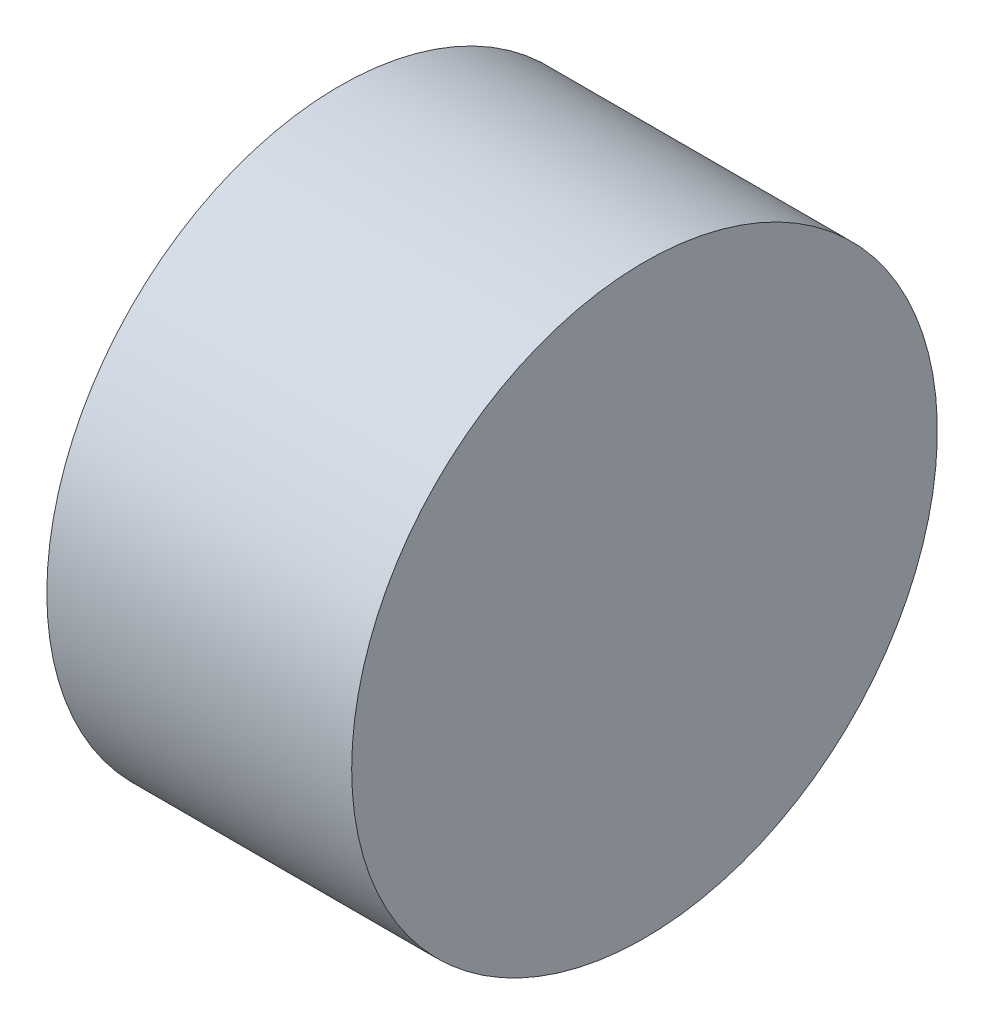
ISO-10303-21;
HEADER;
FILE_DESCRIPTION(('STEP AP214'),'2;1');
FILE_NAME('part.step','',(''),(''),'','','');
FILE_SCHEMA(('AUTOMOTIVE_DESIGN { 1 0 10303 214 1 1 1 1 }'));
ENDSEC;
DATA;
#1=APPLICATION_CONTEXT('core data for automotive mechanical design processes');
#2=APPLICATION_PROTOCOL_DEFINITION('international standard','automotive_design',2000,#1);
#3=PRODUCT_CONTEXT('',#1,'mechanical');
#4=PRODUCT('Part','Part','',(#3));
#5=PRODUCT_RELATED_PRODUCT_CATEGORY('part','',(#4));
#6=PRODUCT_DEFINITION_FORMATION('','',#4);
#7=PRODUCT_DEFINITION_CONTEXT('part definition',#1,'design');
#8=PRODUCT_DEFINITION('design','',#6,#7);
#9=PRODUCT_DEFINITION_SHAPE('','',#8);
#10=(LENGTH_UNIT() NAMED_UNIT(*) SI_UNIT(.MILLI.,.METRE.));
#11=(NAMED_UNIT(*) PLANE_ANGLE_UNIT() SI_UNIT($,.RADIAN.));
#12=(NAMED_UNIT(*) SI_UNIT($,.STERADIAN.) SOLID_ANGLE_UNIT());
#13=UNCERTAINTY_MEASURE_WITH_UNIT(LENGTH_MEASURE(1.E-05),#10,'distance_accuracy_value','');
#14=(GEOMETRIC_REPRESENTATION_CONTEXT(3) GLOBAL_UNCERTAINTY_ASSIGNED_CONTEXT((#13)) GLOBAL_UNIT_ASSIGNED_CONTEXT((#10,
#11,#12)) REPRESENTATION_CONTEXT('',''));
#15=CARTESIAN_POINT('',(0.,0.,0.));
#16=DIRECTION('',(0.,0.,1.));
#17=DIRECTION('',(1.,0.,0.));
#18=AXIS2_PLACEMENT_3D('',#15,#16,#17);
#19=CARTESIAN_POINT('',(0.,0.,-12.2000000000035));
#20=DIRECTION('',(-1.,0.,0.));
#21=DIRECTION('',(0.,0.,1.));
#22=AXIS2_PLACEMENT_3D('',#19,#20,#21);
#23=PLANE('',#22);
#24=CARTESIAN_POINT('',(0.,0.,0.));
#25=DIRECTION('',(-1.,0.,0.));
#26=DIRECTION('',(0.,0.,1.));
#27=AXIS2_PLACEMENT_3D('',#24,#25,#26);
#28=CIRCLE('',#27,12.2000000000035);
#29=CARTESIAN_POINT('',(0.,0.,12.2000000000035));
#30=VERTEX_POINT('',#29);
#31=EDGE_CURVE('E222',#30,#30,#28,.T.);
#32=ORIENTED_EDGE('',*,*,#31,.F.);
#33=EDGE_LOOP('',(#32));
#34=FACE_BOUND('',#33,.T.);
#35=ADVANCED_FACE('F36',(#34),#23,.F.);
#36=CARTESIAN_POINT('',(-16.7,0.,0.));
#37=DIRECTION('',(1.,0.,0.));
#38=DIRECTION('',(0.,0.,-1.));
#39=AXIS2_PLACEMENT_3D('',#36,#37,#38);
#40=PLANE('',#39);
#41=CARTESIAN_POINT('',(-16.7,0.,0.));
#42=DIRECTION('',(-1.,0.,0.));
#43=DIRECTION('',(0.,0.,1.));
#44=AXIS2_PLACEMENT_3D('',#41,#42,#43);
#45=CIRCLE('',#44,3.);
#46=CARTESIAN_POINT('',(-16.7,0.,3.));
#47=VERTEX_POINT('',#46);
#48=EDGE_CURVE('E11',#47,#47,#45,.T.);
#49=ORIENTED_EDGE('',*,*,#48,.T.);
#50=EDGE_LOOP('',(#49));
#51=FACE_BOUND('',#50,.T.);
#52=ADVANCED_FACE('F253',(#51),#40,.F.);
#53=CARTESIAN_POINT('',(-159.613189405079,0.,0.));
#54=DIRECTION('',(-1.,0.,0.));
#55=DIRECTION('',(0.,0.,1.));
#56=AXIS2_PLACEMENT_3D('',#53,#54,#55);
#57=CYLINDRICAL_SURFACE('',#56,3.);
#58=ORIENTED_EDGE('',*,*,#48,.F.);
#59=EDGE_LOOP('',(#58));
#60=FACE_BOUND('',#59,.T.);
#61=CARTESIAN_POINT('',(-12.7,0.,0.));
#62=DIRECTION('',(-1.,0.,0.));
#63=DIRECTION('',(0.,0.,1.));
#64=AXIS2_PLACEMENT_3D('',#61,#62,#63);
#65=CIRCLE('',#64,3.);
#66=CARTESIAN_POINT('',(-12.7,0.,3.));
#67=VERTEX_POINT('',#66);
#68=EDGE_CURVE('E43',#67,#67,#65,.T.);
#69=ORIENTED_EDGE('',*,*,#68,.T.);
#70=EDGE_LOOP('',(#69));
#71=FACE_BOUND('',#70,.T.);
#72=ADVANCED_FACE('F236',(#60,#71),#57,.T.);
#73=CARTESIAN_POINT('',(-12.7,0.,-3.));
#74=DIRECTION('',(1.,0.,0.));
#75=DIRECTION('',(0.,0.,-1.));
#76=AXIS2_PLACEMENT_3D('',#73,#74,#75);
#77=PLANE('',#76);
#78=CARTESIAN_POINT('',(-12.7,-5.0835038482262,0.));
#79=DIRECTION('',(-1.,0.,0.));
#80=DIRECTION('',(0.,0.,1.));
#81=AXIS2_PLACEMENT_3D('',#78,#79,#80);
#82=CIRCLE('',#81,0.65);
#83=CARTESIAN_POINT('',(-12.7,-5.0835038482262,0.649999999999983));
#84=VERTEX_POINT('',#83);
#85=EDGE_CURVE('E385',#84,#84,#82,.T.);
#86=ORIENTED_EDGE('',*,*,#85,.F.);
#87=EDGE_LOOP('',(#86));
#88=FACE_BOUND('',#87,.T.);
#89=CARTESIAN_POINT('',(-12.7,5.0835038482262,0.));
#90=DIRECTION('',(-1.,0.,0.));
#91=DIRECTION('',(0.,0.,1.));
#92=AXIS2_PLACEMENT_3D('',#89,#90,#91);
#93=CIRCLE('',#92,0.65);
#94=CARTESIAN_POINT('',(-12.7,5.0835038482262,0.649999999999982));
#95=VERTEX_POINT('',#94);
#96=EDGE_CURVE('E384',#95,#95,#93,.T.);
#97=ORIENTED_EDGE('',*,*,#96,.F.);
#98=EDGE_LOOP('',(#97));
#99=FACE_BOUND('',#98,.T.);
#100=CARTESIAN_POINT('',(-12.7,-7.57819435487428,-4.85499436866322));
#101=DIRECTION('',(-1.,0.,0.));
#102=DIRECTION('',(0.,0.,1.));
#103=AXIS2_PLACEMENT_3D('',#100,#101,#102);
#104=CIRCLE('',#103,0.749999999999999);
#105=CARTESIAN_POINT('',(-12.7,-7.57819435487428,-4.10499436866322));
#106=VERTEX_POINT('',#105);
#107=EDGE_CURVE('E394',#106,#106,#104,.T.);
#108=ORIENTED_EDGE('',*,*,#107,.F.);
#109=EDGE_LOOP('',(#108));
#110=FACE_BOUND('',#109,.T.);
#111=CARTESIAN_POINT('',(-12.7,-5.16494921498341,-3.3089411776744));
#112=DIRECTION('',(-1.,0.,0.));
#113=DIRECTION('',(0.,0.,1.));
#114=AXIS2_PLACEMENT_3D('',#111,#112,#113);
#115=CIRCLE('',#114,0.749999999999997);
#116=CARTESIAN_POINT('',(-12.7,-5.16494921498341,-2.5589411776744));
#117=VERTEX_POINT('',#116);
#118=EDGE_CURVE('E406',#117,#117,#115,.T.);
#119=ORIENTED_EDGE('',*,*,#118,.F.);
#120=EDGE_LOOP('',(#119));
#121=FACE_BOUND('',#120,.T.);
#122=CARTESIAN_POINT('',(-12.7,-0.415451281055558,8.99040601046857));
#123=DIRECTION('',(-1.,0.,0.));
#124=DIRECTION('',(0.,0.,1.));
#125=AXIS2_PLACEMENT_3D('',#122,#123,#124);
#126=CIRCLE('',#125,0.75);
#127=CARTESIAN_POINT('',(-12.7,-0.415451281055558,9.74040601046857));
#128=VERTEX_POINT('',#127);
#129=EDGE_CURVE('E400',#128,#128,#126,.T.);
#130=ORIENTED_EDGE('',*,*,#129,.F.);
#131=EDGE_LOOP('',(#130));
#132=FACE_BOUND('',#131,.T.);
#133=CARTESIAN_POINT('',(-12.7,-0.283152512002689,6.12744781826933));
#134=DIRECTION('',(-1.,0.,0.));
#135=DIRECTION('',(0.,0.,1.));
#136=AXIS2_PLACEMENT_3D('',#133,#134,#135);
#137=CIRCLE('',#136,0.75);
#138=CARTESIAN_POINT('',(-12.7,-0.283152512002689,6.87744781826933));
#139=VERTEX_POINT('',#138);
#140=EDGE_CURVE('E399',#139,#139,#137,.T.);
#141=ORIENTED_EDGE('',*,*,#140,.F.);
#142=EDGE_LOOP('',(#141));
#143=FACE_BOUND('',#142,.T.);
#144=CARTESIAN_POINT('',(-12.7,7.99364563592984,-4.13541164180542));
#145=DIRECTION('',(-1.,0.,0.));
#146=DIRECTION('',(0.,0.,1.));
#147=AXIS2_PLACEMENT_3D('',#144,#145,#146);
#148=CIRCLE('',#147,0.749999999999999);
#149=CARTESIAN_POINT('',(-12.7,7.99364563592984,-3.38541164180542));
#150=VERTEX_POINT('',#149);
#151=EDGE_CURVE('E417',#150,#150,#148,.T.);
#152=ORIENTED_EDGE('',*,*,#151,.F.);
#153=EDGE_LOOP('',(#152));
#154=FACE_BOUND('',#153,.T.);
#155=CARTESIAN_POINT('',(-12.7,5.44810172698611,-2.81850664059499));
#156=DIRECTION('',(-1.,0.,0.));
#157=DIRECTION('',(0.,0.,1.));
#158=AXIS2_PLACEMENT_3D('',#155,#156,#157);
#159=CIRCLE('',#158,0.749999999999998);
#160=CARTESIAN_POINT('',(-12.7,5.44810172698611,-2.06850664059499));
#161=VERTEX_POINT('',#160);
#162=EDGE_CURVE('E150',#161,#161,#159,.T.);
#163=ORIENTED_EDGE('',*,*,#162,.F.);
#164=EDGE_LOOP('',(#163));
#165=FACE_BOUND('',#164,.T.);
#166=CARTESIAN_POINT('',(-12.7,0.,0.));
#167=DIRECTION('',(-1.,0.,0.));
#168=DIRECTION('',(0.,0.,1.));
#169=AXIS2_PLACEMENT_3D('',#166,#167,#168);
#170=CIRCLE('',#169,11.);
#171=CARTESIAN_POINT('',(-12.7,7.69478931895491,7.86067537409461));
#172=VERTEX_POINT('',#171);
#173=CARTESIAN_POINT('',(-12.7,10.357432093874,3.70453781473321));
#174=VERTEX_POINT('',#173);
#175=EDGE_CURVE('E156',#172,#174,#170,.T.);
#176=ORIENTED_EDGE('',*,*,#175,.F.);
#177=CARTESIAN_POINT('',(-12.7,7.70986986942216,6.44654222018102));
#178=DIRECTION('',(-1.,0.,0.));
#179=DIRECTION('',(0.,0.,1.));
#180=AXIS2_PLACEMENT_3D('',#177,#178,#179);
#181=CIRCLE('',#180,1.41421356237309);
#182=CARTESIAN_POINT('',(-12.7,6.29573671550856,6.43146166971377));
#183=VERTEX_POINT('',#182);
#184=EDGE_CURVE('E50',#183,#172,#181,.T.);
#185=ORIENTED_EDGE('',*,*,#184,.F.);
#186=CARTESIAN_POINT('',(-12.7,0.,0.));
#187=DIRECTION('',(1.,0.,0.));
#188=DIRECTION('',(0.,0.,1.));
#189=AXIS2_PLACEMENT_3D('',#186,#187,#188);
#190=CIRCLE('',#189,9.);
#191=CARTESIAN_POINT('',(-12.7,8.47426262226057,3.03098548478172));
#192=VERTEX_POINT('',#191);
#193=EDGE_CURVE('E144',#192,#183,#190,.T.);
#194=ORIENTED_EDGE('',*,*,#193,.F.);
#195=CARTESIAN_POINT('',(-12.7,9.07907119309155,4.3093463855642));
#196=DIRECTION('',(-1.,0.,0.));
#197=DIRECTION('',(0.,0.,-1.));
#198=AXIS2_PLACEMENT_3D('',#195,#196,#197);
#199=CIRCLE('',#198,1.4142135623731);
#200=EDGE_CURVE('E147',#174,#192,#199,.T.);
#201=ORIENTED_EDGE('',*,*,#200,.F.);
#202=EDGE_LOOP('',(#176,#185,#194,#201));
#203=FACE_BOUND('',#202,.T.);
#204=CARTESIAN_POINT('',(-12.7,0.,0.));
#205=DIRECTION('',(-1.,0.,0.));
#206=DIRECTION('',(0.,0.,1.));
#207=AXIS2_PLACEMENT_3D('',#204,#205,#206);
#208=CIRCLE('',#207,11.);
#209=CARTESIAN_POINT('',(-12.7,-10.6549392243461,2.73354533993676));
#210=VERTEX_POINT('',#209);
#211=CARTESIAN_POINT('',(-12.7,-8.3869399037761,7.11753040390052));
#212=VERTEX_POINT('',#211);
#213=EDGE_CURVE('E182',#210,#212,#208,.T.);
#214=ORIENTED_EDGE('',*,*,#213,.F.);
#215=CARTESIAN_POINT('',(-12.7,-9.43780426395679,3.45367205670125));
#216=DIRECTION('',(-1.,0.,0.));
#217=DIRECTION('',(0.,0.,1.));
#218=AXIS2_PLACEMENT_3D('',#215,#216,#217);
#219=CIRCLE('',#218,1.4142135623731);
#220=CARTESIAN_POINT('',(-12.7,-8.7176775471923,2.2365370963119));
#221=VERTEX_POINT('',#220);
#222=EDGE_CURVE('E58',#221,#210,#219,.T.);
#223=ORIENTED_EDGE('',*,*,#222,.F.);
#224=CARTESIAN_POINT('',(-12.7,0.,0.));
#225=DIRECTION('',(1.,0.,0.));
#226=DIRECTION('',(0.,0.,1.));
#227=AXIS2_PLACEMENT_3D('',#224,#225,#226);
#228=CIRCLE('',#227,9.);
#229=CARTESIAN_POINT('',(-12.7,-6.86204173945317,5.82343396682769));
#230=VERTEX_POINT('',#229);
#231=EDGE_CURVE('E171',#230,#221,#228,.T.);
#232=ORIENTED_EDGE('',*,*,#231,.F.);
#233=CARTESIAN_POINT('',(-12.7,-8.27153904015104,5.70803310320264));
#234=DIRECTION('',(-1.,0.,0.));
#235=DIRECTION('',(0.,0.,-1.));
#236=AXIS2_PLACEMENT_3D('',#233,#234,#235);
#237=CIRCLE('',#236,1.4142135623731);
#238=EDGE_CURVE('E186',#212,#230,#237,.T.);
#239=ORIENTED_EDGE('',*,*,#238,.F.);
#240=EDGE_LOOP('',(#214,#223,#232,#239));
#241=FACE_BOUND('',#240,.T.);
#242=CARTESIAN_POINT('',(-12.7,0.,0.));
#243=DIRECTION('',(-1.,0.,0.));
#244=DIRECTION('',(0.,0.,1.));
#245=AXIS2_PLACEMENT_3D('',#242,#243,#244);
#246=CIRCLE('',#245,11.);
#247=CARTESIAN_POINT('',(-12.7,2.96014990539117,-10.5942207140314));
#248=VERTEX_POINT('',#247);
#249=CARTESIAN_POINT('',(-12.7,-1.97049219009802,-10.8220682186338));
#250=VERTEX_POINT('',#249);
#251=EDGE_CURVE('E212',#248,#250,#246,.T.);
#252=ORIENTED_EDGE('',*,*,#251,.F.);
#253=CARTESIAN_POINT('',(-12.7,1.72793439453457,-9.90021427688231));
#254=DIRECTION('',(-1.,0.,0.));
#255=DIRECTION('',(0.,0.,1.));
#256=AXIS2_PLACEMENT_3D('',#253,#254,#255);
#257=CIRCLE('',#256,1.41421356237309);
#258=CARTESIAN_POINT('',(-12.7,2.42194083168369,-8.66799876602571));
#259=VERTEX_POINT('',#258);
#260=EDGE_CURVE('E163',#259,#248,#257,.T.);
#261=ORIENTED_EDGE('',*,*,#260,.F.);
#262=CARTESIAN_POINT('',(-12.7,0.,0.));
#263=DIRECTION('',(1.,0.,0.));
#264=DIRECTION('',(0.,0.,1.));
#265=AXIS2_PLACEMENT_3D('',#262,#263,#264);
#266=CIRCLE('',#265,9.);
#267=CARTESIAN_POINT('',(-12.7,-1.61222088280747,-8.85441945160943));
#268=VERTEX_POINT('',#267);
#269=EDGE_CURVE('E201',#268,#259,#266,.T.);
#270=ORIENTED_EDGE('',*,*,#269,.F.);
#271=CARTESIAN_POINT('',(-12.7,-0.807532152940578,-10.0173794887669));
#272=DIRECTION('',(-1.,0.,0.));
#273=DIRECTION('',(0.,0.,-1.));
#274=AXIS2_PLACEMENT_3D('',#271,#272,#273);
#275=CIRCLE('',#274,1.4142135623731);
#276=EDGE_CURVE('E215',#250,#268,#275,.T.);
#277=ORIENTED_EDGE('',*,*,#276,.F.);
#278=EDGE_LOOP('',(#252,#261,#270,#277));
#279=FACE_BOUND('',#278,.T.);
#280=ORIENTED_EDGE('',*,*,#68,.F.);
#281=EDGE_LOOP('',(#280));
#282=FACE_BOUND('',#281,.T.);
#283=CARTESIAN_POINT('',(-12.7,0.,0.));
#284=DIRECTION('',(-1.,0.,0.));
#285=DIRECTION('',(0.,0.,1.));
#286=AXIS2_PLACEMENT_3D('',#283,#284,#285);
#287=CIRCLE('',#286,12.2);
#288=CARTESIAN_POINT('',(-12.7,0.,12.2));
#289=VERTEX_POINT('',#288);
#290=EDGE_CURVE('E231',#289,#289,#287,.T.);
#291=ORIENTED_EDGE('',*,*,#290,.T.);
#292=EDGE_LOOP('',(#291));
#293=FACE_BOUND('',#292,.T.);
#294=ADVANCED_FACE('F238',(#88,#99,#110,#121,#132,#143,#154,#165,#203,#241,#279,#282,#293),#77,.F.);
#295=CARTESIAN_POINT('',(-159.613189405079,0.,0.));
#296=DIRECTION('',(-1.,0.,0.));
#297=DIRECTION('',(0.,0.,1.));
#298=AXIS2_PLACEMENT_3D('',#295,#296,#297);
#299=CYLINDRICAL_SURFACE('',#298,12.2000000000018);
#300=ORIENTED_EDGE('',*,*,#290,.F.);
#301=EDGE_LOOP('',(#300));
#302=FACE_BOUND('',#301,.T.);
#303=ORIENTED_EDGE('',*,*,#31,.T.);
#304=EDGE_LOOP('',(#303));
#305=FACE_BOUND('',#304,.T.);
#306=ADVANCED_FACE('F241',(#302,#305),#299,.T.);
#307=CARTESIAN_POINT('',(-9.7,1.72793439453457,-9.90021427688231));
#308=DIRECTION('',(-1.,0.,0.));
#309=DIRECTION('',(0.,0.,1.));
#310=AXIS2_PLACEMENT_3D('',#307,#308,#309);
#311=CYLINDRICAL_SURFACE('',#310,1.41421356237309);
#312=ORIENTED_EDGE('',*,*,#260,.T.);
#313=DIRECTION('',(-1.,0.,0.));
#314=VECTOR('',#313,1.);
#315=CARTESIAN_POINT('',(-9.7,2.96014990539117,-10.5942207140314));
#316=LINE('',#315,#314);
#317=CARTESIAN_POINT('',(-9.7,2.96014990539117,-10.5942207140314));
#318=VERTEX_POINT('',#317);
#319=EDGE_CURVE('E210',#318,#248,#316,.T.);
#320=ORIENTED_EDGE('',*,*,#319,.F.);
#321=CARTESIAN_POINT('',(-9.7,1.72793439453457,-9.90021427688231));
#322=DIRECTION('',(-1.,0.,0.));
#323=DIRECTION('',(0.,0.,1.));
#324=AXIS2_PLACEMENT_3D('',#321,#322,#323);
#325=CIRCLE('',#324,1.41421356237309);
#326=CARTESIAN_POINT('',(-9.7,2.42194083168369,-8.66799876602571));
#327=VERTEX_POINT('',#326);
#328=EDGE_CURVE('E197',#327,#318,#325,.T.);
#329=ORIENTED_EDGE('',*,*,#328,.F.);
#330=DIRECTION('',(-1.,0.,0.));
#331=VECTOR('',#330,1.);
#332=CARTESIAN_POINT('',(-9.7,2.42194083168369,-8.66799876602571));
#333=LINE('',#332,#331);
#334=EDGE_CURVE('E220',#327,#259,#333,.T.);
#335=ORIENTED_EDGE('',*,*,#334,.T.);
#336=EDGE_LOOP('',(#312,#320,#329,#335));
#337=FACE_BOUND('',#336,.T.);
#338=ADVANCED_FACE('F248',(#337),#311,.F.);
#339=CARTESIAN_POINT('',(-9.7,0.,0.));
#340=DIRECTION('',(-1.,0.,0.));
#341=DIRECTION('',(0.,0.,1.));
#342=AXIS2_PLACEMENT_3D('',#339,#340,#341);
#343=CYLINDRICAL_SURFACE('',#342,9.);
#344=ORIENTED_EDGE('',*,*,#269,.T.);
#345=ORIENTED_EDGE('',*,*,#334,.F.);
#346=CARTESIAN_POINT('',(-9.7,0.,0.));
#347=DIRECTION('',(1.,0.,0.));
#348=DIRECTION('',(0.,0.,1.));
#349=AXIS2_PLACEMENT_3D('',#346,#347,#348);
#350=CIRCLE('',#349,9.);
#351=CARTESIAN_POINT('',(-9.7,-1.61222088280747,-8.85441945160943));
#352=VERTEX_POINT('',#351);
#353=EDGE_CURVE('E207',#352,#327,#350,.T.);
#354=ORIENTED_EDGE('',*,*,#353,.F.);
#355=DIRECTION('',(-1.,0.,0.));
#356=VECTOR('',#355,1.);
#357=CARTESIAN_POINT('',(-9.7,-1.61222088280747,-8.85441945160943));
#358=LINE('',#357,#356);
#359=EDGE_CURVE('E223',#352,#268,#358,.T.);
#360=ORIENTED_EDGE('',*,*,#359,.T.);
#361=EDGE_LOOP('',(#344,#345,#354,#360));
#362=FACE_BOUND('',#361,.T.);
#363=ADVANCED_FACE('F266',(#362),#343,.T.);
#364=CARTESIAN_POINT('',(-9.7,-0.807532152940578,-10.0173794887669));
#365=DIRECTION('',(-1.,0.,0.));
#366=DIRECTION('',(0.,0.,1.));
#367=AXIS2_PLACEMENT_3D('',#364,#365,#366);
#368=CYLINDRICAL_SURFACE('',#367,1.4142135623731);
#369=ORIENTED_EDGE('',*,*,#276,.T.);
#370=ORIENTED_EDGE('',*,*,#359,.F.);
#371=CARTESIAN_POINT('',(-9.7,-0.807532152940578,-10.0173794887669));
#372=DIRECTION('',(-1.,0.,0.));
#373=DIRECTION('',(0.,0.,-1.));
#374=AXIS2_PLACEMENT_3D('',#371,#372,#373);
#375=CIRCLE('',#374,1.4142135623731);
#376=CARTESIAN_POINT('',(-9.7,-1.97049219009802,-10.8220682186338));
#377=VERTEX_POINT('',#376);
#378=EDGE_CURVE('E204',#377,#352,#375,.T.);
#379=ORIENTED_EDGE('',*,*,#378,.F.);
#380=DIRECTION('',(-1.,0.,0.));
#381=VECTOR('',#380,1.);
#382=CARTESIAN_POINT('',(-9.7,-1.97049219009802,-10.8220682186338));
#383=LINE('',#382,#381);
#384=EDGE_CURVE('E225',#377,#250,#383,.T.);
#385=ORIENTED_EDGE('',*,*,#384,.T.);
#386=EDGE_LOOP('',(#369,#370,#379,#385));
#387=FACE_BOUND('',#386,.T.);
#388=ADVANCED_FACE('F272',(#387),#368,.F.);
#389=CARTESIAN_POINT('',(-9.7,0.,0.));
#390=DIRECTION('',(-1.,0.,0.));
#391=DIRECTION('',(0.,0.,1.));
#392=AXIS2_PLACEMENT_3D('',#389,#390,#391);
#393=CYLINDRICAL_SURFACE('',#392,11.);
#394=ORIENTED_EDGE('',*,*,#251,.T.);
#395=ORIENTED_EDGE('',*,*,#384,.F.);
#396=CARTESIAN_POINT('',(-9.7,0.,0.));
#397=DIRECTION('',(-1.,0.,0.));
#398=DIRECTION('',(0.,0.,1.));
#399=AXIS2_PLACEMENT_3D('',#396,#397,#398);
#400=CIRCLE('',#399,11.);
#401=EDGE_CURVE('E200',#318,#377,#400,.T.);
#402=ORIENTED_EDGE('',*,*,#401,.F.);
#403=ORIENTED_EDGE('',*,*,#319,.T.);
#404=EDGE_LOOP('',(#394,#395,#402,#403));
#405=FACE_BOUND('',#404,.T.);
#406=ADVANCED_FACE('F268',(#405),#393,.F.);
#407=CARTESIAN_POINT('',(-9.7,0.863967197267286,-4.95010713844116));
#408=DIRECTION('',(-1.,0.,0.));
#409=DIRECTION('',(0.,0.,1.));
#410=AXIS2_PLACEMENT_3D('',#407,#408,#409);
#411=PLANE('',#410);
#412=ORIENTED_EDGE('',*,*,#328,.T.);
#413=ORIENTED_EDGE('',*,*,#401,.T.);
#414=ORIENTED_EDGE('',*,*,#378,.T.);
#415=ORIENTED_EDGE('',*,*,#353,.T.);
#416=EDGE_LOOP('',(#412,#413,#414,#415));
#417=FACE_BOUND('',#416,.T.);
#418=ADVANCED_FACE('F271',(#417),#411,.T.);
#419=CARTESIAN_POINT('',(-9.7,-9.43780426395679,3.45367205670125));
#420=DIRECTION('',(-1.,0.,0.));
#421=DIRECTION('',(0.,0.,1.));
#422=AXIS2_PLACEMENT_3D('',#419,#420,#421);
#423=CYLINDRICAL_SURFACE('',#422,1.4142135623731);
#424=ORIENTED_EDGE('',*,*,#222,.T.);
#425=DIRECTION('',(-1.,0.,0.));
#426=VECTOR('',#425,1.);
#427=CARTESIAN_POINT('',(-9.7,-10.6549392243461,2.73354533993676));
#428=LINE('',#427,#426);
#429=CARTESIAN_POINT('',(-9.7,-10.6549392243461,2.73354533993676));
#430=VERTEX_POINT('',#429);
#431=EDGE_CURVE('E180',#430,#210,#428,.T.);
#432=ORIENTED_EDGE('',*,*,#431,.F.);
#433=CARTESIAN_POINT('',(-9.7,-9.43780426395679,3.45367205670125));
#434=DIRECTION('',(-1.,0.,0.));
#435=DIRECTION('',(0.,0.,1.));
#436=AXIS2_PLACEMENT_3D('',#433,#434,#435);
#437=CIRCLE('',#436,1.4142135623731);
#438=CARTESIAN_POINT('',(-9.7,-8.7176775471923,2.2365370963119));
#439=VERTEX_POINT('',#438);
#440=EDGE_CURVE('E167',#439,#430,#437,.T.);
#441=ORIENTED_EDGE('',*,*,#440,.F.);
#442=DIRECTION('',(-1.,0.,0.));
#443=VECTOR('',#442,1.);
#444=CARTESIAN_POINT('',(-9.7,-8.7176775471923,2.2365370963119));
#445=LINE('',#444,#443);
#446=EDGE_CURVE('E157',#439,#221,#445,.T.);
#447=ORIENTED_EDGE('',*,*,#446,.T.);
#448=EDGE_LOOP('',(#424,#432,#441,#447));
#449=FACE_BOUND('',#448,.T.);
#450=ADVANCED_FACE('F282',(#449),#423,.F.);
#451=CARTESIAN_POINT('',(-9.7,0.,0.));
#452=DIRECTION('',(-1.,0.,0.));
#453=DIRECTION('',(0.,0.,1.));
#454=AXIS2_PLACEMENT_3D('',#451,#452,#453);
#455=CYLINDRICAL_SURFACE('',#454,9.);
#456=ORIENTED_EDGE('',*,*,#231,.T.);
#457=ORIENTED_EDGE('',*,*,#446,.F.);
#458=CARTESIAN_POINT('',(-9.7,0.,0.));
#459=DIRECTION('',(1.,0.,0.));
#460=DIRECTION('',(0.,0.,1.));
#461=AXIS2_PLACEMENT_3D('',#458,#459,#460);
#462=CIRCLE('',#461,9.);
#463=CARTESIAN_POINT('',(-9.7,-6.86204173945317,5.82343396682769));
#464=VERTEX_POINT('',#463);
#465=EDGE_CURVE('E177',#464,#439,#462,.T.);
#466=ORIENTED_EDGE('',*,*,#465,.F.);
#467=DIRECTION('',(-1.,0.,0.));
#468=VECTOR('',#467,1.);
#469=CARTESIAN_POINT('',(-9.7,-6.86204173945317,5.82343396682769));
#470=LINE('',#469,#468);
#471=EDGE_CURVE('E192',#464,#230,#470,.T.);
#472=ORIENTED_EDGE('',*,*,#471,.T.);
#473=EDGE_LOOP('',(#456,#457,#466,#472));
#474=FACE_BOUND('',#473,.T.);
#475=ADVANCED_FACE('F286',(#474),#455,.T.);
#476=CARTESIAN_POINT('',(-9.7,-8.27153904015104,5.70803310320264));
#477=DIRECTION('',(-1.,0.,0.));
#478=DIRECTION('',(0.,0.,1.));
#479=AXIS2_PLACEMENT_3D('',#476,#477,#478);
#480=CYLINDRICAL_SURFACE('',#479,1.4142135623731);
#481=ORIENTED_EDGE('',*,*,#238,.T.);
#482=ORIENTED_EDGE('',*,*,#471,.F.);
#483=CARTESIAN_POINT('',(-9.7,-8.27153904015104,5.70803310320264));
#484=DIRECTION('',(-1.,0.,0.));
#485=DIRECTION('',(0.,0.,-1.));
#486=AXIS2_PLACEMENT_3D('',#483,#484,#485);
#487=CIRCLE('',#486,1.4142135623731);
#488=CARTESIAN_POINT('',(-9.7,-8.3869399037761,7.11753040390052));
#489=VERTEX_POINT('',#488);
#490=EDGE_CURVE('E174',#489,#464,#487,.T.);
#491=ORIENTED_EDGE('',*,*,#490,.F.);
#492=DIRECTION('',(-1.,0.,0.));
#493=VECTOR('',#492,1.);
#494=CARTESIAN_POINT('',(-9.7,-8.3869399037761,7.11753040390052));
#495=LINE('',#494,#493);
#496=EDGE_CURVE('E194',#489,#212,#495,.T.);
#497=ORIENTED_EDGE('',*,*,#496,.T.);
#498=EDGE_LOOP('',(#481,#482,#491,#497));
#499=FACE_BOUND('',#498,.T.);
#500=ADVANCED_FACE('F291',(#499),#480,.F.);
#501=CARTESIAN_POINT('',(-9.7,0.,0.));
#502=DIRECTION('',(-1.,0.,0.));
#503=DIRECTION('',(0.,0.,1.));
#504=AXIS2_PLACEMENT_3D('',#501,#502,#503);
#505=CYLINDRICAL_SURFACE('',#504,11.);
#506=ORIENTED_EDGE('',*,*,#213,.T.);
#507=ORIENTED_EDGE('',*,*,#496,.F.);
#508=CARTESIAN_POINT('',(-9.7,0.,0.));
#509=DIRECTION('',(-1.,0.,0.));
#510=DIRECTION('',(0.,0.,1.));
#511=AXIS2_PLACEMENT_3D('',#508,#509,#510);
#512=CIRCLE('',#511,11.);
#513=EDGE_CURVE('E170',#430,#489,#512,.T.);
#514=ORIENTED_EDGE('',*,*,#513,.F.);
#515=ORIENTED_EDGE('',*,*,#431,.T.);
#516=EDGE_LOOP('',(#506,#507,#514,#515));
#517=FACE_BOUND('',#516,.T.);
#518=ADVANCED_FACE('F287',(#517),#505,.F.);
#519=CARTESIAN_POINT('',(-9.7,-4.71890213197839,1.72683602835062));
#520=DIRECTION('',(-1.,0.,0.));
#521=DIRECTION('',(0.,0.,1.));
#522=AXIS2_PLACEMENT_3D('',#519,#520,#521);
#523=PLANE('',#522);
#524=ORIENTED_EDGE('',*,*,#440,.T.);
#525=ORIENTED_EDGE('',*,*,#513,.T.);
#526=ORIENTED_EDGE('',*,*,#490,.T.);
#527=ORIENTED_EDGE('',*,*,#465,.T.);
#528=EDGE_LOOP('',(#524,#525,#526,#527));
#529=FACE_BOUND('',#528,.T.);
#530=ADVANCED_FACE('F290',(#529),#523,.T.);
#531=CARTESIAN_POINT('',(-9.7,7.70986986942216,6.44654222018102));
#532=DIRECTION('',(-1.,0.,0.));
#533=DIRECTION('',(0.,0.,1.));
#534=AXIS2_PLACEMENT_3D('',#531,#532,#533);
#535=CYLINDRICAL_SURFACE('',#534,1.41421356237309);
#536=ORIENTED_EDGE('',*,*,#184,.T.);
#537=DIRECTION('',(-1.,0.,0.));
#538=VECTOR('',#537,1.);
#539=CARTESIAN_POINT('',(-9.7,7.69478931895491,7.86067537409461));
#540=LINE('',#539,#538);
#541=CARTESIAN_POINT('',(-9.7,7.69478931895491,7.86067537409461));
#542=VERTEX_POINT('',#541);
#543=EDGE_CURVE('E122',#542,#172,#540,.T.);
#544=ORIENTED_EDGE('',*,*,#543,.F.);
#545=CARTESIAN_POINT('',(-9.7,7.70986986942216,6.44654222018102));
#546=DIRECTION('',(-1.,0.,0.));
#547=DIRECTION('',(0.,0.,1.));
#548=AXIS2_PLACEMENT_3D('',#545,#546,#547);
#549=CIRCLE('',#548,1.41421356237309);
#550=CARTESIAN_POINT('',(-9.7,6.29573671550856,6.43146166971377));
#551=VERTEX_POINT('',#550);
#552=EDGE_CURVE('E126',#551,#542,#549,.T.);
#553=ORIENTED_EDGE('',*,*,#552,.F.);
#554=DIRECTION('',(-1.,0.,0.));
#555=VECTOR('',#554,1.);
#556=CARTESIAN_POINT('',(-9.7,6.29573671550856,6.43146166971377));
#557=LINE('',#556,#555);
#558=EDGE_CURVE('E161',#551,#183,#557,.T.);
#559=ORIENTED_EDGE('',*,*,#558,.T.);
#560=EDGE_LOOP('',(#536,#544,#553,#559));
#561=FACE_BOUND('',#560,.T.);
#562=ADVANCED_FACE('F124',(#561),#535,.F.);
#563=CARTESIAN_POINT('',(-9.7,0.,0.));
#564=DIRECTION('',(-1.,0.,0.));
#565=DIRECTION('',(0.,0.,1.));
#566=AXIS2_PLACEMENT_3D('',#563,#564,#565);
#567=CYLINDRICAL_SURFACE('',#566,9.);
#568=ORIENTED_EDGE('',*,*,#193,.T.);
#569=ORIENTED_EDGE('',*,*,#558,.F.);
#570=CARTESIAN_POINT('',(-9.7,0.,0.));
#571=DIRECTION('',(1.,0.,0.));
#572=DIRECTION('',(0.,0.,1.));
#573=AXIS2_PLACEMENT_3D('',#570,#571,#572);
#574=CIRCLE('',#573,9.);
#575=CARTESIAN_POINT('',(-9.7,8.47426262226057,3.03098548478172));
#576=VERTEX_POINT('',#575);
#577=EDGE_CURVE('E132',#576,#551,#574,.T.);
#578=ORIENTED_EDGE('',*,*,#577,.F.);
#579=DIRECTION('',(-1.,0.,0.));
#580=VECTOR('',#579,1.);
#581=CARTESIAN_POINT('',(-9.7,8.47426262226057,3.03098548478172));
#582=LINE('',#581,#580);
#583=EDGE_CURVE('E164',#576,#192,#582,.T.);
#584=ORIENTED_EDGE('',*,*,#583,.T.);
#585=EDGE_LOOP('',(#568,#569,#578,#584));
#586=FACE_BOUND('',#585,.T.);
#587=ADVANCED_FACE('F304',(#586),#567,.T.);
#588=CARTESIAN_POINT('',(-9.7,9.07907119309155,4.3093463855642));
#589=DIRECTION('',(-1.,0.,0.));
#590=DIRECTION('',(0.,0.,1.));
#591=AXIS2_PLACEMENT_3D('',#588,#589,#590);
#592=CYLINDRICAL_SURFACE('',#591,1.4142135623731);
#593=ORIENTED_EDGE('',*,*,#200,.T.);
#594=ORIENTED_EDGE('',*,*,#583,.F.);
#595=CARTESIAN_POINT('',(-9.7,9.07907119309155,4.3093463855642));
#596=DIRECTION('',(-1.,0.,0.));
#597=DIRECTION('',(0.,0.,-1.));
#598=AXIS2_PLACEMENT_3D('',#595,#596,#597);
#599=CIRCLE('',#598,1.4142135623731);
#600=CARTESIAN_POINT('',(-9.7,10.357432093874,3.70453781473321));
#601=VERTEX_POINT('',#600);
#602=EDGE_CURVE('E140',#601,#576,#599,.T.);
#603=ORIENTED_EDGE('',*,*,#602,.F.);
#604=DIRECTION('',(-1.,0.,0.));
#605=VECTOR('',#604,1.);
#606=CARTESIAN_POINT('',(-9.7,10.357432093874,3.70453781473321));
#607=LINE('',#606,#605);
#608=EDGE_CURVE('E131',#601,#174,#607,.T.);
#609=ORIENTED_EDGE('',*,*,#608,.T.);
#610=EDGE_LOOP('',(#593,#594,#603,#609));
#611=FACE_BOUND('',#610,.T.);
#612=ADVANCED_FACE('F307',(#611),#592,.F.);
#613=CARTESIAN_POINT('',(-9.7,0.,0.));
#614=DIRECTION('',(-1.,0.,0.));
#615=DIRECTION('',(0.,0.,1.));
#616=AXIS2_PLACEMENT_3D('',#613,#614,#615);
#617=CYLINDRICAL_SURFACE('',#616,11.);
#618=ORIENTED_EDGE('',*,*,#175,.T.);
#619=ORIENTED_EDGE('',*,*,#608,.F.);
#620=CARTESIAN_POINT('',(-9.7,0.,0.));
#621=DIRECTION('',(-1.,0.,0.));
#622=DIRECTION('',(0.,0.,1.));
#623=AXIS2_PLACEMENT_3D('',#620,#621,#622);
#624=CIRCLE('',#623,11.);
#625=EDGE_CURVE('E135',#542,#601,#624,.T.);
#626=ORIENTED_EDGE('',*,*,#625,.F.);
#627=ORIENTED_EDGE('',*,*,#543,.T.);
#628=EDGE_LOOP('',(#618,#619,#626,#627));
#629=FACE_BOUND('',#628,.T.);
#630=ADVANCED_FACE('F136',(#629),#617,.F.);
#631=CARTESIAN_POINT('',(-9.7,3.85493493471108,3.22327111009051));
#632=DIRECTION('',(-1.,0.,0.));
#633=DIRECTION('',(0.,0.,1.));
#634=AXIS2_PLACEMENT_3D('',#631,#632,#633);
#635=PLANE('',#634);
#636=ORIENTED_EDGE('',*,*,#552,.T.);
#637=ORIENTED_EDGE('',*,*,#625,.T.);
#638=ORIENTED_EDGE('',*,*,#602,.T.);
#639=ORIENTED_EDGE('',*,*,#577,.T.);
#640=EDGE_LOOP('',(#636,#637,#638,#639));
#641=FACE_BOUND('',#640,.T.);
#642=ADVANCED_FACE('F142',(#641),#635,.T.);
#643=CARTESIAN_POINT('',(-9.7,5.44810172698611,-2.81850664059499));
#644=DIRECTION('',(-1.,0.,0.));
#645=DIRECTION('',(0.,0.,1.));
#646=AXIS2_PLACEMENT_3D('',#643,#644,#645);
#647=CYLINDRICAL_SURFACE('',#646,0.749999999999998);
#648=CARTESIAN_POINT('',(-9.7,5.44810172698611,-2.81850664059499));
#649=DIRECTION('',(-1.,0.,0.));
#650=DIRECTION('',(0.,0.,1.));
#651=AXIS2_PLACEMENT_3D('',#648,#649,#650);
#652=CIRCLE('',#651,0.749999999999998);
#653=CARTESIAN_POINT('',(-9.7,5.44810172698611,-2.06850664059499));
#654=VERTEX_POINT('',#653);
#655=EDGE_CURVE('E183',#654,#654,#652,.T.);
#656=ORIENTED_EDGE('',*,*,#655,.F.);
#657=EDGE_LOOP('',(#656));
#658=FACE_BOUND('',#657,.T.);
#659=ORIENTED_EDGE('',*,*,#162,.T.);
#660=EDGE_LOOP('',(#659));
#661=FACE_BOUND('',#660,.T.);
#662=ADVANCED_FACE('F316',(#658,#661),#647,.F.);
#663=CARTESIAN_POINT('',(-9.7,5.44810172698611,-2.81850664059499));
#664=DIRECTION('',(-1.,0.,0.));
#665=DIRECTION('',(0.,0.,1.));
#666=AXIS2_PLACEMENT_3D('',#663,#664,#665);
#667=PLANE('',#666);
#668=ORIENTED_EDGE('',*,*,#655,.T.);
#669=EDGE_LOOP('',(#668));
#670=FACE_BOUND('',#669,.T.);
#671=ADVANCED_FACE('F319',(#670),#667,.T.);
#672=CARTESIAN_POINT('',(-9.7,7.99364563592984,-4.13541164180542));
#673=DIRECTION('',(-1.,0.,0.));
#674=DIRECTION('',(0.,0.,1.));
#675=AXIS2_PLACEMENT_3D('',#672,#673,#674);
#676=CYLINDRICAL_SURFACE('',#675,0.749999999999999);
#677=CARTESIAN_POINT('',(-9.7,7.99364563592984,-4.13541164180542));
#678=DIRECTION('',(-1.,0.,0.));
#679=DIRECTION('',(0.,0.,1.));
#680=AXIS2_PLACEMENT_3D('',#677,#678,#679);
#681=CIRCLE('',#680,0.749999999999999);
#682=CARTESIAN_POINT('',(-9.7,7.99364563592984,-3.38541164180542));
#683=VERTEX_POINT('',#682);
#684=EDGE_CURVE('E414',#683,#683,#681,.T.);
#685=ORIENTED_EDGE('',*,*,#684,.F.);
#686=EDGE_LOOP('',(#685));
#687=FACE_BOUND('',#686,.T.);
#688=ORIENTED_EDGE('',*,*,#151,.T.);
#689=EDGE_LOOP('',(#688));
#690=FACE_BOUND('',#689,.T.);
#691=ADVANCED_FACE('F323',(#687,#690),#676,.F.);
#692=CARTESIAN_POINT('',(-9.7,7.99364563592984,-4.13541164180542));
#693=DIRECTION('',(-1.,0.,0.));
#694=DIRECTION('',(0.,0.,1.));
#695=AXIS2_PLACEMENT_3D('',#692,#693,#694);
#696=PLANE('',#695);
#697=ORIENTED_EDGE('',*,*,#684,.T.);
#698=EDGE_LOOP('',(#697));
#699=FACE_BOUND('',#698,.T.);
#700=ADVANCED_FACE('F329',(#699),#696,.T.);
#701=CARTESIAN_POINT('',(-9.7,-0.283152512002689,6.12744781826933));
#702=DIRECTION('',(-1.,0.,0.));
#703=DIRECTION('',(0.,0.,1.));
#704=AXIS2_PLACEMENT_3D('',#701,#702,#703);
#705=CYLINDRICAL_SURFACE('',#704,0.75);
#706=CARTESIAN_POINT('',(-9.7,-0.283152512002689,6.12744781826933));
#707=DIRECTION('',(-1.,0.,0.));
#708=DIRECTION('',(0.,0.,1.));
#709=AXIS2_PLACEMENT_3D('',#706,#707,#708);
#710=CIRCLE('',#709,0.75);
#711=CARTESIAN_POINT('',(-9.7,-0.283152512002689,6.87744781826933));
#712=VERTEX_POINT('',#711);
#713=EDGE_CURVE('E420',#712,#712,#710,.T.);
#714=ORIENTED_EDGE('',*,*,#713,.F.);
#715=EDGE_LOOP('',(#714));
#716=FACE_BOUND('',#715,.T.);
#717=ORIENTED_EDGE('',*,*,#140,.T.);
#718=EDGE_LOOP('',(#717));
#719=FACE_BOUND('',#718,.T.);
#720=ADVANCED_FACE('F325',(#716,#719),#705,.F.);
#721=CARTESIAN_POINT('',(-9.7,-0.283152512002689,6.12744781826933));
#722=DIRECTION('',(-1.,0.,0.));
#723=DIRECTION('',(0.,0.,1.));
#724=AXIS2_PLACEMENT_3D('',#721,#722,#723);
#725=PLANE('',#724);
#726=ORIENTED_EDGE('',*,*,#713,.T.);
#727=EDGE_LOOP('',(#726));
#728=FACE_BOUND('',#727,.T.);
#729=ADVANCED_FACE('F328',(#728),#725,.T.);
#730=CARTESIAN_POINT('',(-9.7,-0.415451281055558,8.99040601046857));
#731=DIRECTION('',(-1.,0.,0.));
#732=DIRECTION('',(0.,0.,1.));
#733=AXIS2_PLACEMENT_3D('',#730,#731,#732);
#734=CYLINDRICAL_SURFACE('',#733,0.75);
#735=CARTESIAN_POINT('',(-9.7,-0.415451281055558,8.99040601046857));
#736=DIRECTION('',(-1.,0.,0.));
#737=DIRECTION('',(0.,0.,1.));
#738=AXIS2_PLACEMENT_3D('',#735,#736,#737);
#739=CIRCLE('',#738,0.75);
#740=CARTESIAN_POINT('',(-9.7,-0.415451281055558,9.74040601046857));
#741=VERTEX_POINT('',#740);
#742=EDGE_CURVE('E396',#741,#741,#739,.T.);
#743=ORIENTED_EDGE('',*,*,#742,.F.);
#744=EDGE_LOOP('',(#743));
#745=FACE_BOUND('',#744,.T.);
#746=ORIENTED_EDGE('',*,*,#129,.T.);
#747=EDGE_LOOP('',(#746));
#748=FACE_BOUND('',#747,.T.);
#749=ADVANCED_FACE('F333',(#745,#748),#734,.F.);
#750=CARTESIAN_POINT('',(-9.7,-0.415451281055558,8.99040601046857));
#751=DIRECTION('',(-1.,0.,0.));
#752=DIRECTION('',(0.,0.,1.));
#753=AXIS2_PLACEMENT_3D('',#750,#751,#752);
#754=PLANE('',#753);
#755=ORIENTED_EDGE('',*,*,#742,.T.);
#756=EDGE_LOOP('',(#755));
#757=FACE_BOUND('',#756,.T.);
#758=ADVANCED_FACE('F354',(#757),#754,.T.);
#759=CARTESIAN_POINT('',(-9.7,-5.16494921498341,-3.3089411776744));
#760=DIRECTION('',(-1.,0.,0.));
#761=DIRECTION('',(0.,0.,1.));
#762=AXIS2_PLACEMENT_3D('',#759,#760,#761);
#763=CYLINDRICAL_SURFACE('',#762,0.749999999999997);
#764=CARTESIAN_POINT('',(-9.7,-5.16494921498341,-3.3089411776744));
#765=DIRECTION('',(-1.,0.,0.));
#766=DIRECTION('',(0.,0.,1.));
#767=AXIS2_PLACEMENT_3D('',#764,#765,#766);
#768=CIRCLE('',#767,0.749999999999997);
#769=CARTESIAN_POINT('',(-9.7,-5.16494921498341,-2.5589411776744));
#770=VERTEX_POINT('',#769);
#771=EDGE_CURVE('E403',#770,#770,#768,.T.);
#772=ORIENTED_EDGE('',*,*,#771,.F.);
#773=EDGE_LOOP('',(#772));
#774=FACE_BOUND('',#773,.T.);
#775=ORIENTED_EDGE('',*,*,#118,.T.);
#776=EDGE_LOOP('',(#775));
#777=FACE_BOUND('',#776,.T.);
#778=ADVANCED_FACE('F351',(#774,#777),#763,.F.);
#779=CARTESIAN_POINT('',(-9.7,-5.16494921498341,-3.3089411776744));
#780=DIRECTION('',(-1.,0.,0.));
#781=DIRECTION('',(0.,0.,1.));
#782=AXIS2_PLACEMENT_3D('',#779,#780,#781);
#783=PLANE('',#782);
#784=ORIENTED_EDGE('',*,*,#771,.T.);
#785=EDGE_LOOP('',(#784));
#786=FACE_BOUND('',#785,.T.);
#787=ADVANCED_FACE('F345',(#786),#783,.T.);
#788=CARTESIAN_POINT('',(-9.7,-7.57819435487428,-4.85499436866322));
#789=DIRECTION('',(-1.,0.,0.));
#790=DIRECTION('',(0.,0.,1.));
#791=AXIS2_PLACEMENT_3D('',#788,#789,#790);
#792=CYLINDRICAL_SURFACE('',#791,0.749999999999999);
#793=CARTESIAN_POINT('',(-9.7,-7.57819435487428,-4.85499436866322));
#794=DIRECTION('',(-1.,0.,0.));
#795=DIRECTION('',(0.,0.,1.));
#796=AXIS2_PLACEMENT_3D('',#793,#794,#795);
#797=CIRCLE('',#796,0.749999999999999);
#798=CARTESIAN_POINT('',(-9.7,-7.57819435487428,-4.10499436866322));
#799=VERTEX_POINT('',#798);
#800=EDGE_CURVE('E409',#799,#799,#797,.T.);
#801=ORIENTED_EDGE('',*,*,#800,.F.);
#802=EDGE_LOOP('',(#801));
#803=FACE_BOUND('',#802,.T.);
#804=ORIENTED_EDGE('',*,*,#107,.T.);
#805=EDGE_LOOP('',(#804));
#806=FACE_BOUND('',#805,.T.);
#807=ADVANCED_FACE('F341',(#803,#806),#792,.F.);
#808=CARTESIAN_POINT('',(-9.7,-7.57819435487428,-4.85499436866322));
#809=DIRECTION('',(-1.,0.,0.));
#810=DIRECTION('',(0.,0.,1.));
#811=AXIS2_PLACEMENT_3D('',#808,#809,#810);
#812=PLANE('',#811);
#813=ORIENTED_EDGE('',*,*,#800,.T.);
#814=EDGE_LOOP('',(#813));
#815=FACE_BOUND('',#814,.T.);
#816=ADVANCED_FACE('F344',(#815),#812,.T.);
#817=CARTESIAN_POINT('',(-9.7,5.0835038482262,0.));
#818=DIRECTION('',(-1.,0.,0.));
#819=DIRECTION('',(0.,0.,1.));
#820=AXIS2_PLACEMENT_3D('',#817,#818,#819);
#821=CYLINDRICAL_SURFACE('',#820,0.65);
#822=CARTESIAN_POINT('',(-9.7,5.0835038482262,0.));
#823=DIRECTION('',(-1.,0.,0.));
#824=DIRECTION('',(0.,0.,1.));
#825=AXIS2_PLACEMENT_3D('',#822,#823,#824);
#826=CIRCLE('',#825,0.65);
#827=CARTESIAN_POINT('',(-9.7,5.0835038482262,0.649999999999982));
#828=VERTEX_POINT('',#827);
#829=EDGE_CURVE('E388',#828,#828,#826,.T.);
#830=ORIENTED_EDGE('',*,*,#829,.F.);
#831=EDGE_LOOP('',(#830));
#832=FACE_BOUND('',#831,.T.);
#833=ORIENTED_EDGE('',*,*,#96,.T.);
#834=EDGE_LOOP('',(#833));
#835=FACE_BOUND('',#834,.T.);
#836=ADVANCED_FACE('F349',(#832,#835),#821,.F.);
#837=CARTESIAN_POINT('',(-9.7,5.0835038482262,0.));
#838=DIRECTION('',(-1.,0.,0.));
#839=DIRECTION('',(0.,0.,1.));
#840=AXIS2_PLACEMENT_3D('',#837,#838,#839);
#841=PLANE('',#840);
#842=ORIENTED_EDGE('',*,*,#829,.T.);
#843=EDGE_LOOP('',(#842));
#844=FACE_BOUND('',#843,.T.);
#845=ADVANCED_FACE('F367',(#844),#841,.T.);
#846=CARTESIAN_POINT('',(-9.7,-5.0835038482262,0.));
#847=DIRECTION('',(-1.,0.,0.));
#848=DIRECTION('',(0.,0.,1.));
#849=AXIS2_PLACEMENT_3D('',#846,#847,#848);
#850=CYLINDRICAL_SURFACE('',#849,0.65);
#851=CARTESIAN_POINT('',(-9.7,-5.0835038482262,0.));
#852=DIRECTION('',(-1.,0.,0.));
#853=DIRECTION('',(0.,0.,1.));
#854=AXIS2_PLACEMENT_3D('',#851,#852,#853);
#855=CIRCLE('',#854,0.65);
#856=CARTESIAN_POINT('',(-9.7,-5.0835038482262,0.649999999999983));
#857=VERTEX_POINT('',#856);
#858=EDGE_CURVE('E383',#857,#857,#855,.T.);
#859=ORIENTED_EDGE('',*,*,#858,.F.);
#860=EDGE_LOOP('',(#859));
#861=FACE_BOUND('',#860,.T.);
#862=ORIENTED_EDGE('',*,*,#85,.T.);
#863=EDGE_LOOP('',(#862));
#864=FACE_BOUND('',#863,.T.);
#865=ADVANCED_FACE('F371',(#861,#864),#850,.F.);
#866=CARTESIAN_POINT('',(-9.7,-5.0835038482262,0.));
#867=DIRECTION('',(-1.,0.,0.));
#868=DIRECTION('',(0.,0.,1.));
#869=AXIS2_PLACEMENT_3D('',#866,#867,#868);
#870=PLANE('',#869);
#871=ORIENTED_EDGE('',*,*,#858,.T.);
#872=EDGE_LOOP('',(#871));
#873=FACE_BOUND('',#872,.T.);
#874=ADVANCED_FACE('F375',(#873),#870,.T.);
#875=CLOSED_SHELL('',(#35,#52,#72,#294,#306,#338,#363,#388,#406,#418,#450,#475,#500,#518,#530,
#562,#587,#612,#630,#642,#662,#671,#691,#700,#720,#729,#749,#758,#778,#787,#807,#816,#836,#845,
#865,#874));
#876=MANIFOLD_SOLID_BREP('B2',#875);
#877=ADVANCED_BREP_SHAPE_REPRESENTATION('',(#18,#876),#14);
#878=SHAPE_DEFINITION_REPRESENTATION(#9,#877);
ENDSEC;
END-ISO-10303-21;
